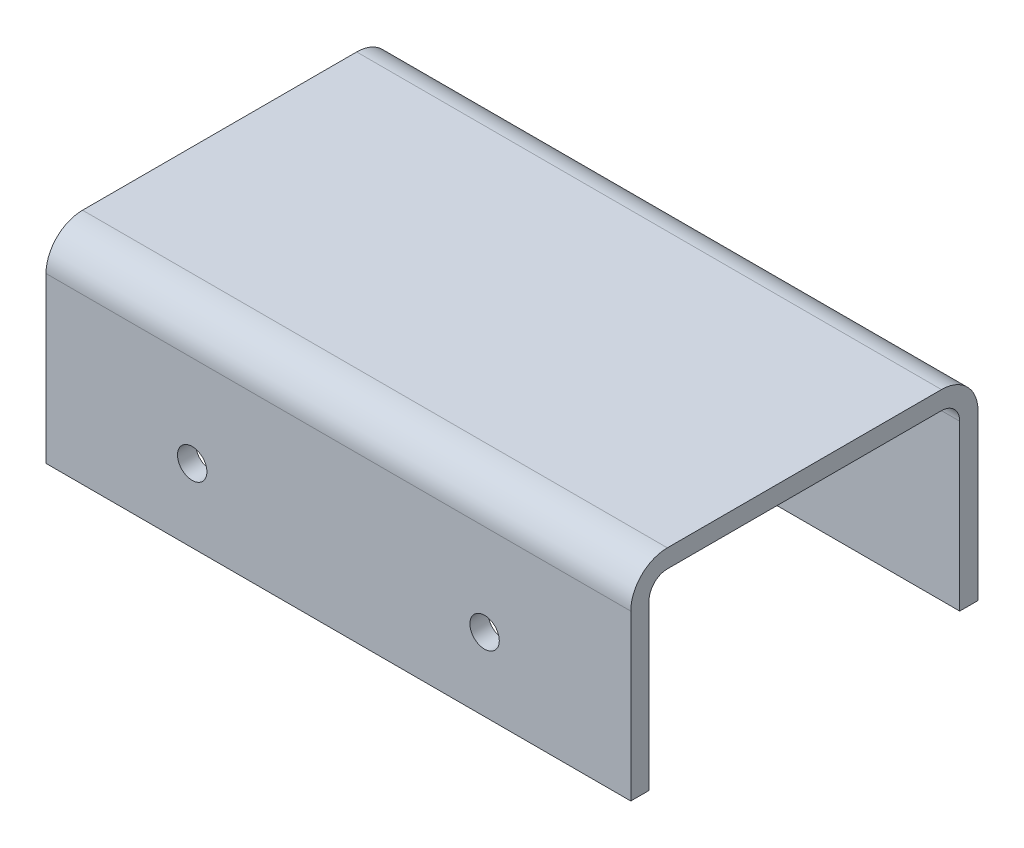
ISO-10303-21;
HEADER;
FILE_DESCRIPTION(('STEP AP214'),'2;1');
FILE_NAME('part.step','',(''),(''),'','','');
FILE_SCHEMA(('AUTOMOTIVE_DESIGN { 1 0 10303 214 1 1 1 1 }'));
ENDSEC;
DATA;
#1=APPLICATION_CONTEXT('core data for automotive mechanical design processes');
#2=APPLICATION_PROTOCOL_DEFINITION('international standard','automotive_design',2000,#1);
#3=PRODUCT_CONTEXT('',#1,'mechanical');
#4=PRODUCT('Part','Part','',(#3));
#5=PRODUCT_RELATED_PRODUCT_CATEGORY('part','',(#4));
#6=PRODUCT_DEFINITION_FORMATION('','',#4);
#7=PRODUCT_DEFINITION_CONTEXT('part definition',#1,'design');
#8=PRODUCT_DEFINITION('design','',#6,#7);
#9=PRODUCT_DEFINITION_SHAPE('','',#8);
#10=(LENGTH_UNIT() NAMED_UNIT(*) SI_UNIT(.MILLI.,.METRE.));
#11=(NAMED_UNIT(*) PLANE_ANGLE_UNIT() SI_UNIT($,.RADIAN.));
#12=(NAMED_UNIT(*) SI_UNIT($,.STERADIAN.) SOLID_ANGLE_UNIT());
#13=UNCERTAINTY_MEASURE_WITH_UNIT(LENGTH_MEASURE(1.E-05),#10,'distance_accuracy_value','');
#14=(GEOMETRIC_REPRESENTATION_CONTEXT(3) GLOBAL_UNCERTAINTY_ASSIGNED_CONTEXT((#13)) GLOBAL_UNIT_ASSIGNED_CONTEXT((#10,
#11,#12)) REPRESENTATION_CONTEXT('',''));
#15=CARTESIAN_POINT('',(0.,0.,0.));
#16=DIRECTION('',(0.,0.,1.));
#17=DIRECTION('',(1.,0.,0.));
#18=AXIS2_PLACEMENT_3D('',#15,#16,#17);
#19=CARTESIAN_POINT('',(-25.4,-22.225,-39.512875));
#20=DIRECTION('',(0.,0.,1.));
#21=DIRECTION('',(1.,0.,0.));
#22=AXIS2_PLACEMENT_3D('',#19,#20,#21);
#23=CYLINDRICAL_SURFACE('',#22,2.5527);
#24=CARTESIAN_POINT('',(-25.4,-22.225,30.1625));
#25=DIRECTION('',(0.,0.,1.));
#26=DIRECTION('',(1.,0.,0.));
#27=AXIS2_PLACEMENT_3D('',#24,#25,#26);
#28=CIRCLE('',#27,2.5527);
#29=CARTESIAN_POINT('',(-22.8473,-22.225,30.1625));
#30=VERTEX_POINT('',#29);
#31=EDGE_CURVE('P0_E168',#30,#30,#28,.F.);
#32=ORIENTED_EDGE('',*,*,#31,.F.);
#33=EDGE_LOOP('',(#32));
#34=FACE_BOUND('',#33,.T.);
#35=CARTESIAN_POINT('',(-25.4,-22.225,26.9875));
#36=DIRECTION('',(0.,0.,1.));
#37=DIRECTION('',(1.,0.,0.));
#38=AXIS2_PLACEMENT_3D('',#35,#36,#37);
#39=CIRCLE('',#38,2.5527);
#40=CARTESIAN_POINT('',(-22.8473,-22.225,26.9875));
#41=VERTEX_POINT('',#40);
#42=EDGE_CURVE('P0_E20',#41,#41,#39,.T.);
#43=ORIENTED_EDGE('',*,*,#42,.F.);
#44=EDGE_LOOP('',(#43));
#45=FACE_BOUND('',#44,.T.);
#46=ADVANCED_FACE('P0_F17',(#34,#45),#23,.F.);
#47=CARTESIAN_POINT('',(25.4,-22.225,-39.512875));
#48=DIRECTION('',(0.,0.,1.));
#49=DIRECTION('',(1.,0.,0.));
#50=AXIS2_PLACEMENT_3D('',#47,#48,#49);
#51=CYLINDRICAL_SURFACE('',#50,2.5527);
#52=CARTESIAN_POINT('',(25.4,-22.225,30.1625));
#53=DIRECTION('',(0.,0.,1.));
#54=DIRECTION('',(1.,0.,0.));
#55=AXIS2_PLACEMENT_3D('',#52,#53,#54);
#56=CIRCLE('',#55,2.5527);
#57=CARTESIAN_POINT('',(27.9527,-22.225,30.1625));
#58=VERTEX_POINT('',#57);
#59=EDGE_CURVE('P0_E178',#58,#58,#56,.F.);
#60=ORIENTED_EDGE('',*,*,#59,.F.);
#61=EDGE_LOOP('',(#60));
#62=FACE_BOUND('',#61,.T.);
#63=CARTESIAN_POINT('',(25.4,-22.225,26.9875));
#64=DIRECTION('',(0.,0.,1.));
#65=DIRECTION('',(1.,0.,0.));
#66=AXIS2_PLACEMENT_3D('',#63,#64,#65);
#67=CIRCLE('',#66,2.5527);
#68=CARTESIAN_POINT('',(27.9527,-22.225,26.9875));
#69=VERTEX_POINT('',#68);
#70=EDGE_CURVE('P0_E196',#69,#69,#67,.T.);
#71=ORIENTED_EDGE('',*,*,#70,.F.);
#72=EDGE_LOOP('',(#71));
#73=FACE_BOUND('',#72,.T.);
#74=ADVANCED_FACE('P0_F236',(#62,#73),#51,.F.);
#75=CARTESIAN_POINT('',(-50.8,-34.925,30.1625));
#76=DIRECTION('',(0.,-1.,0.));
#77=DIRECTION('',(0.,0.,-1.));
#78=AXIS2_PLACEMENT_3D('',#75,#76,#77);
#79=PLANE('',#78);
#80=DIRECTION('',(1.,0.,0.));
#81=VECTOR('',#80,1.);
#82=CARTESIAN_POINT('',(-50.8,-34.925,30.1625));
#83=LINE('',#82,#81);
#84=CARTESIAN_POINT('',(-50.8,-34.925,30.1625));
#85=VERTEX_POINT('',#84);
#86=CARTESIAN_POINT('',(50.8,-34.925,30.1625));
#87=VERTEX_POINT('',#86);
#88=EDGE_CURVE('P0_E165',#85,#87,#83,.T.);
#89=ORIENTED_EDGE('',*,*,#88,.F.);
#90=DIRECTION('',(0.,0.,-1.));
#91=VECTOR('',#90,1.);
#92=CARTESIAN_POINT('',(-50.8,-34.925,0.));
#93=LINE('',#92,#91);
#94=CARTESIAN_POINT('',(-50.8,-34.925,26.9875));
#95=VERTEX_POINT('',#94);
#96=EDGE_CURVE('P0_E171',#85,#95,#93,.T.);
#97=ORIENTED_EDGE('',*,*,#96,.T.);
#98=DIRECTION('',(-1.,0.,0.));
#99=VECTOR('',#98,1.);
#100=CARTESIAN_POINT('',(-50.8,-34.925,26.9875));
#101=LINE('',#100,#99);
#102=CARTESIAN_POINT('',(50.8,-34.925,26.9875));
#103=VERTEX_POINT('',#102);
#104=EDGE_CURVE('P0_E91',#103,#95,#101,.T.);
#105=ORIENTED_EDGE('',*,*,#104,.F.);
#106=DIRECTION('',(0.,0.,-1.));
#107=VECTOR('',#106,1.);
#108=CARTESIAN_POINT('',(50.8,-34.925,0.));
#109=LINE('',#108,#107);
#110=EDGE_CURVE('P0_E200',#87,#103,#109,.T.);
#111=ORIENTED_EDGE('',*,*,#110,.F.);
#112=EDGE_LOOP('',(#89,#97,#105,#111));
#113=FACE_BOUND('',#112,.T.);
#114=ADVANCED_FACE('P0_F242',(#113),#79,.T.);
#115=CARTESIAN_POINT('',(-50.8,-34.925,26.9875));
#116=DIRECTION('',(0.,0.,-1.));
#117=DIRECTION('',(-1.,0.,0.));
#118=AXIS2_PLACEMENT_3D('',#115,#116,#117);
#119=PLANE('',#118);
#120=ORIENTED_EDGE('',*,*,#70,.T.);
#121=EDGE_LOOP('',(#120));
#122=FACE_BOUND('',#121,.T.);
#123=ORIENTED_EDGE('',*,*,#42,.T.);
#124=EDGE_LOOP('',(#123));
#125=FACE_BOUND('',#124,.T.);
#126=ORIENTED_EDGE('',*,*,#104,.T.);
#127=DIRECTION('',(0.,1.,0.));
#128=VECTOR('',#127,1.);
#129=CARTESIAN_POINT('',(-50.8,0.,26.9875));
#130=LINE('',#129,#128);
#131=CARTESIAN_POINT('',(-50.8,-6.35,26.9875));
#132=VERTEX_POINT('',#131);
#133=EDGE_CURVE('P0_E173',#95,#132,#130,.T.);
#134=ORIENTED_EDGE('',*,*,#133,.T.);
#135=DIRECTION('',(1.,0.,0.));
#136=VECTOR('',#135,1.);
#137=CARTESIAN_POINT('',(-50.8,-6.35,26.9875));
#138=LINE('',#137,#136);
#139=CARTESIAN_POINT('',(50.8,-6.35,26.9875));
#140=VERTEX_POINT('',#139);
#141=EDGE_CURVE('P0_E82',#132,#140,#138,.T.);
#142=ORIENTED_EDGE('',*,*,#141,.T.);
#143=DIRECTION('',(0.,1.,0.));
#144=VECTOR('',#143,1.);
#145=CARTESIAN_POINT('',(50.8,0.,26.9875));
#146=LINE('',#145,#144);
#147=EDGE_CURVE('P0_E160',#103,#140,#146,.T.);
#148=ORIENTED_EDGE('',*,*,#147,.F.);
#149=EDGE_LOOP('',(#126,#134,#142,#148));
#150=FACE_BOUND('',#149,.T.);
#151=ADVANCED_FACE('P0_F233',(#122,#125,#150),#119,.T.);
#152=CARTESIAN_POINT('',(-50.8,-6.35,23.8125));
#153=DIRECTION('',(1.,0.,0.));
#154=DIRECTION('',(0.,0.,-1.));
#155=AXIS2_PLACEMENT_3D('',#152,#153,#154);
#156=CYLINDRICAL_SURFACE('',#155,3.175);
#157=CARTESIAN_POINT('',(50.8,-6.35,23.8125));
#158=DIRECTION('',(1.,0.,0.));
#159=DIRECTION('',(0.,0.,-1.));
#160=AXIS2_PLACEMENT_3D('',#157,#158,#159);
#161=CIRCLE('',#160,3.175);
#162=CARTESIAN_POINT('',(50.8,-3.175,23.8125));
#163=VERTEX_POINT('',#162);
#164=EDGE_CURVE('P0_E159',#140,#163,#161,.F.);
#165=ORIENTED_EDGE('',*,*,#164,.F.);
#166=ORIENTED_EDGE('',*,*,#141,.F.);
#167=CARTESIAN_POINT('',(-50.8,-6.35,23.8125));
#168=DIRECTION('',(1.,0.,0.));
#169=DIRECTION('',(0.,0.,-1.));
#170=AXIS2_PLACEMENT_3D('',#167,#168,#169);
#171=CIRCLE('',#170,3.175);
#172=CARTESIAN_POINT('',(-50.8,-3.175,23.8125));
#173=VERTEX_POINT('',#172);
#174=EDGE_CURVE('P0_E215',#132,#173,#171,.F.);
#175=ORIENTED_EDGE('',*,*,#174,.T.);
#176=DIRECTION('',(1.,0.,0.));
#177=VECTOR('',#176,1.);
#178=CARTESIAN_POINT('',(-50.8,-3.175,23.8125));
#179=LINE('',#178,#177);
#180=EDGE_CURVE('P0_E192',#163,#173,#179,.F.);
#181=ORIENTED_EDGE('',*,*,#180,.F.);
#182=EDGE_LOOP('',(#165,#166,#175,#181));
#183=FACE_BOUND('',#182,.T.);
#184=ADVANCED_FACE('P0_F284',(#183),#156,.F.);
#185=CARTESIAN_POINT('',(-50.8,-3.175,23.8125));
#186=DIRECTION('',(0.,-1.,0.));
#187=DIRECTION('',(0.,0.,-1.));
#188=AXIS2_PLACEMENT_3D('',#185,#186,#187);
#189=PLANE('',#188);
#190=ORIENTED_EDGE('',*,*,#180,.T.);
#191=DIRECTION('',(0.,0.,-1.));
#192=VECTOR('',#191,1.);
#193=CARTESIAN_POINT('',(-50.8,-3.175,0.));
#194=LINE('',#193,#192);
#195=CARTESIAN_POINT('',(-50.8,-3.175,-23.8125));
#196=VERTEX_POINT('',#195);
#197=EDGE_CURVE('P0_E214',#173,#196,#194,.T.);
#198=ORIENTED_EDGE('',*,*,#197,.T.);
#199=DIRECTION('',(1.,0.,0.));
#200=VECTOR('',#199,1.);
#201=CARTESIAN_POINT('',(-50.8,-3.175,-23.8125));
#202=LINE('',#201,#200);
#203=CARTESIAN_POINT('',(50.8,-3.175,-23.8125));
#204=VERTEX_POINT('',#203);
#205=EDGE_CURVE('P0_E190',#196,#204,#202,.T.);
#206=ORIENTED_EDGE('',*,*,#205,.T.);
#207=DIRECTION('',(0.,0.,-1.));
#208=VECTOR('',#207,1.);
#209=CARTESIAN_POINT('',(50.8,-3.175,0.));
#210=LINE('',#209,#208);
#211=EDGE_CURVE('P0_E150',#163,#204,#210,.T.);
#212=ORIENTED_EDGE('',*,*,#211,.F.);
#213=EDGE_LOOP('',(#190,#198,#206,#212));
#214=FACE_BOUND('',#213,.T.);
#215=ADVANCED_FACE('P0_F280',(#214),#189,.T.);
#216=CARTESIAN_POINT('',(-50.8,-6.35,-23.8125));
#217=DIRECTION('',(1.,0.,0.));
#218=DIRECTION('',(0.,0.,-1.));
#219=AXIS2_PLACEMENT_3D('',#216,#217,#218);
#220=CYLINDRICAL_SURFACE('',#219,3.175);
#221=CARTESIAN_POINT('',(50.8,-6.35,-23.8125));
#222=DIRECTION('',(1.,0.,0.));
#223=DIRECTION('',(0.,0.,-1.));
#224=AXIS2_PLACEMENT_3D('',#221,#222,#223);
#225=CIRCLE('',#224,3.175);
#226=CARTESIAN_POINT('',(50.8,-6.35,-26.9875));
#227=VERTEX_POINT('',#226);
#228=EDGE_CURVE('P0_E148',#204,#227,#225,.F.);
#229=ORIENTED_EDGE('',*,*,#228,.F.);
#230=ORIENTED_EDGE('',*,*,#205,.F.);
#231=CARTESIAN_POINT('',(-50.8,-6.35,-23.8125));
#232=DIRECTION('',(1.,0.,0.));
#233=DIRECTION('',(0.,0.,-1.));
#234=AXIS2_PLACEMENT_3D('',#231,#232,#233);
#235=CIRCLE('',#234,3.175);
#236=CARTESIAN_POINT('',(-50.8,-6.35,-26.9875));
#237=VERTEX_POINT('',#236);
#238=EDGE_CURVE('P0_E212',#196,#237,#235,.F.);
#239=ORIENTED_EDGE('',*,*,#238,.T.);
#240=DIRECTION('',(1.,0.,0.));
#241=VECTOR('',#240,1.);
#242=CARTESIAN_POINT('',(-50.8,-6.35,-26.9875));
#243=LINE('',#242,#241);
#244=EDGE_CURVE('P0_E135',#227,#237,#243,.F.);
#245=ORIENTED_EDGE('',*,*,#244,.F.);
#246=EDGE_LOOP('',(#229,#230,#239,#245));
#247=FACE_BOUND('',#246,.T.);
#248=ADVANCED_FACE('P0_F277',(#247),#220,.F.);
#249=CARTESIAN_POINT('',(-50.8,-6.35,-26.9875));
#250=DIRECTION('',(0.,0.,1.));
#251=DIRECTION('',(1.,0.,0.));
#252=AXIS2_PLACEMENT_3D('',#249,#250,#251);
#253=PLANE('',#252);
#254=ORIENTED_EDGE('',*,*,#244,.T.);
#255=DIRECTION('',(0.,1.,0.));
#256=VECTOR('',#255,1.);
#257=CARTESIAN_POINT('',(-50.8,0.,-26.9875));
#258=LINE('',#257,#256);
#259=CARTESIAN_POINT('',(-50.8,-34.925,-26.9875));
#260=VERTEX_POINT('',#259);
#261=EDGE_CURVE('P0_E133',#237,#260,#258,.F.);
#262=ORIENTED_EDGE('',*,*,#261,.T.);
#263=DIRECTION('',(1.,0.,0.));
#264=VECTOR('',#263,1.);
#265=CARTESIAN_POINT('',(-50.8,-34.925,-26.9875));
#266=LINE('',#265,#264);
#267=CARTESIAN_POINT('',(50.8,-34.925,-26.9875));
#268=VERTEX_POINT('',#267);
#269=EDGE_CURVE('P0_E125',#268,#260,#266,.F.);
#270=ORIENTED_EDGE('',*,*,#269,.F.);
#271=DIRECTION('',(0.,1.,0.));
#272=VECTOR('',#271,1.);
#273=CARTESIAN_POINT('',(50.8,0.,-26.9875));
#274=LINE('',#273,#272);
#275=EDGE_CURVE('P0_E130',#227,#268,#274,.F.);
#276=ORIENTED_EDGE('',*,*,#275,.F.);
#277=EDGE_LOOP('',(#254,#262,#270,#276));
#278=FACE_BOUND('',#277,.T.);
#279=ADVANCED_FACE('P0_F128',(#278),#253,.T.);
#280=CARTESIAN_POINT('',(-50.8,-34.925,-26.9875));
#281=DIRECTION('',(0.,-1.,0.));
#282=DIRECTION('',(0.,0.,-1.));
#283=AXIS2_PLACEMENT_3D('',#280,#281,#282);
#284=PLANE('',#283);
#285=ORIENTED_EDGE('',*,*,#269,.T.);
#286=DIRECTION('',(0.,0.,-1.));
#287=VECTOR('',#286,1.);
#288=CARTESIAN_POINT('',(-50.8,-34.925,0.));
#289=LINE('',#288,#287);
#290=CARTESIAN_POINT('',(-50.8,-34.925,-30.1625));
#291=VERTEX_POINT('',#290);
#292=EDGE_CURVE('P0_E116',#260,#291,#289,.T.);
#293=ORIENTED_EDGE('',*,*,#292,.T.);
#294=DIRECTION('',(-1.,0.,0.));
#295=VECTOR('',#294,1.);
#296=CARTESIAN_POINT('',(-50.8,-34.925,-30.1625));
#297=LINE('',#296,#295);
#298=CARTESIAN_POINT('',(50.8,-34.925,-30.1625));
#299=VERTEX_POINT('',#298);
#300=EDGE_CURVE('P0_E134',#299,#291,#297,.T.);
#301=ORIENTED_EDGE('',*,*,#300,.F.);
#302=DIRECTION('',(0.,0.,-1.));
#303=VECTOR('',#302,1.);
#304=CARTESIAN_POINT('',(50.8,-34.925,0.));
#305=LINE('',#304,#303);
#306=EDGE_CURVE('P0_E138',#268,#299,#305,.T.);
#307=ORIENTED_EDGE('',*,*,#306,.F.);
#308=EDGE_LOOP('',(#285,#293,#301,#307));
#309=FACE_BOUND('',#308,.T.);
#310=ADVANCED_FACE('P0_F139',(#309),#284,.T.);
#311=CARTESIAN_POINT('',(-50.8,-34.925,-30.1625));
#312=DIRECTION('',(0.,0.,-1.));
#313=DIRECTION('',(-1.,0.,0.));
#314=AXIS2_PLACEMENT_3D('',#311,#312,#313);
#315=PLANE('',#314);
#316=ORIENTED_EDGE('',*,*,#300,.T.);
#317=DIRECTION('',(0.,1.,0.));
#318=VECTOR('',#317,1.);
#319=CARTESIAN_POINT('',(-50.8,0.,-30.1625));
#320=LINE('',#319,#318);
#321=CARTESIAN_POINT('',(-50.8,-6.35,-30.1625));
#322=VERTEX_POINT('',#321);
#323=EDGE_CURVE('P0_E109',#291,#322,#320,.T.);
#324=ORIENTED_EDGE('',*,*,#323,.T.);
#325=DIRECTION('',(1.,0.,0.));
#326=VECTOR('',#325,1.);
#327=CARTESIAN_POINT('',(-50.8,-6.35,-30.1625));
#328=LINE('',#327,#326);
#329=CARTESIAN_POINT('',(50.8,-6.35,-30.1625));
#330=VERTEX_POINT('',#329);
#331=EDGE_CURVE('P0_E174',#330,#322,#328,.F.);
#332=ORIENTED_EDGE('',*,*,#331,.F.);
#333=DIRECTION('',(0.,1.,0.));
#334=VECTOR('',#333,1.);
#335=CARTESIAN_POINT('',(50.8,0.,-30.1625));
#336=LINE('',#335,#334);
#337=EDGE_CURVE('P0_E142',#299,#330,#336,.T.);
#338=ORIENTED_EDGE('',*,*,#337,.F.);
#339=EDGE_LOOP('',(#316,#324,#332,#338));
#340=FACE_BOUND('',#339,.T.);
#341=ADVANCED_FACE('P0_F269',(#340),#315,.T.);
#342=CARTESIAN_POINT('',(-50.8,-6.35,30.1625));
#343=DIRECTION('',(0.,0.,1.));
#344=DIRECTION('',(1.,0.,0.));
#345=AXIS2_PLACEMENT_3D('',#342,#343,#344);
#346=PLANE('',#345);
#347=ORIENTED_EDGE('',*,*,#59,.T.);
#348=EDGE_LOOP('',(#347));
#349=FACE_BOUND('',#348,.T.);
#350=ORIENTED_EDGE('',*,*,#31,.T.);
#351=EDGE_LOOP('',(#350));
#352=FACE_BOUND('',#351,.T.);
#353=DIRECTION('',(1.,0.,0.));
#354=VECTOR('',#353,1.);
#355=CARTESIAN_POINT('',(-50.8,-6.35,30.1625));
#356=LINE('',#355,#354);
#357=CARTESIAN_POINT('',(-50.8,-6.35,30.1625));
#358=VERTEX_POINT('',#357);
#359=CARTESIAN_POINT('',(50.8,-6.35,30.1625));
#360=VERTEX_POINT('',#359);
#361=EDGE_CURVE('P0_E101',#358,#360,#356,.T.);
#362=ORIENTED_EDGE('',*,*,#361,.F.);
#363=DIRECTION('',(0.,1.,0.));
#364=VECTOR('',#363,1.);
#365=CARTESIAN_POINT('',(-50.8,0.,30.1625));
#366=LINE('',#365,#364);
#367=EDGE_CURVE('P0_E210',#358,#85,#366,.F.);
#368=ORIENTED_EDGE('',*,*,#367,.T.);
#369=ORIENTED_EDGE('',*,*,#88,.T.);
#370=DIRECTION('',(0.,1.,0.));
#371=VECTOR('',#370,1.);
#372=CARTESIAN_POINT('',(50.8,0.,30.1625));
#373=LINE('',#372,#371);
#374=EDGE_CURVE('P0_E203',#360,#87,#373,.F.);
#375=ORIENTED_EDGE('',*,*,#374,.F.);
#376=EDGE_LOOP('',(#362,#368,#369,#375));
#377=FACE_BOUND('',#376,.T.);
#378=ADVANCED_FACE('P0_F265',(#349,#352,#377),#346,.T.);
#379=CARTESIAN_POINT('',(-50.8,-6.35,23.8125));
#380=DIRECTION('',(1.,0.,0.));
#381=DIRECTION('',(0.,0.,-1.));
#382=AXIS2_PLACEMENT_3D('',#379,#380,#381);
#383=CYLINDRICAL_SURFACE('',#382,6.35);
#384=DIRECTION('',(1.,0.,0.));
#385=VECTOR('',#384,1.);
#386=CARTESIAN_POINT('',(-50.8,0.,23.8125));
#387=LINE('',#386,#385);
#388=CARTESIAN_POINT('',(-50.8,0.,23.8125));
#389=VERTEX_POINT('',#388);
#390=CARTESIAN_POINT('',(50.8,0.,23.8125));
#391=VERTEX_POINT('',#390);
#392=EDGE_CURVE('P0_E298',#389,#391,#387,.T.);
#393=ORIENTED_EDGE('',*,*,#392,.F.);
#394=CARTESIAN_POINT('',(-50.8,-6.35,23.8125));
#395=DIRECTION('',(1.,0.,0.));
#396=DIRECTION('',(0.,0.,-1.));
#397=AXIS2_PLACEMENT_3D('',#394,#395,#396);
#398=CIRCLE('',#397,6.35);
#399=EDGE_CURVE('P0_E208',#389,#358,#398,.T.);
#400=ORIENTED_EDGE('',*,*,#399,.T.);
#401=ORIENTED_EDGE('',*,*,#361,.T.);
#402=CARTESIAN_POINT('',(50.8,-6.35,23.8125));
#403=DIRECTION('',(1.,0.,0.));
#404=DIRECTION('',(0.,0.,-1.));
#405=AXIS2_PLACEMENT_3D('',#402,#403,#404);
#406=CIRCLE('',#405,6.35);
#407=EDGE_CURVE('P0_E219',#391,#360,#406,.T.);
#408=ORIENTED_EDGE('',*,*,#407,.F.);
#409=EDGE_LOOP('',(#393,#400,#401,#408));
#410=FACE_BOUND('',#409,.T.);
#411=ADVANCED_FACE('P0_F262',(#410),#383,.T.);
#412=CARTESIAN_POINT('',(50.8,0.,0.));
#413=DIRECTION('',(1.,0.,0.));
#414=DIRECTION('',(0.,0.,-1.));
#415=AXIS2_PLACEMENT_3D('',#412,#413,#414);
#416=PLANE('',#415);
#417=ORIENTED_EDGE('',*,*,#374,.T.);
#418=ORIENTED_EDGE('',*,*,#110,.T.);
#419=ORIENTED_EDGE('',*,*,#147,.T.);
#420=ORIENTED_EDGE('',*,*,#164,.T.);
#421=ORIENTED_EDGE('',*,*,#211,.T.);
#422=ORIENTED_EDGE('',*,*,#228,.T.);
#423=ORIENTED_EDGE('',*,*,#275,.T.);
#424=ORIENTED_EDGE('',*,*,#306,.T.);
#425=ORIENTED_EDGE('',*,*,#337,.T.);
#426=CARTESIAN_POINT('',(50.8,-6.35,-23.8125));
#427=DIRECTION('',(1.,0.,0.));
#428=DIRECTION('',(0.,0.,-1.));
#429=AXIS2_PLACEMENT_3D('',#426,#427,#428);
#430=CIRCLE('',#429,6.35);
#431=CARTESIAN_POINT('',(50.8,0.,-23.8125));
#432=VERTEX_POINT('',#431);
#433=EDGE_CURVE('P0_E180',#432,#330,#430,.F.);
#434=ORIENTED_EDGE('',*,*,#433,.F.);
#435=DIRECTION('',(0.,0.,1.));
#436=VECTOR('',#435,1.);
#437=CARTESIAN_POINT('',(50.8,0.,-23.8125));
#438=LINE('',#437,#436);
#439=EDGE_CURVE('P0_E309',#391,#432,#438,.F.);
#440=ORIENTED_EDGE('',*,*,#439,.F.);
#441=ORIENTED_EDGE('',*,*,#407,.T.);
#442=EDGE_LOOP('',(#417,#418,#419,#420,#421,#422,#423,#424,#425,#434,#440,#441));
#443=FACE_BOUND('',#442,.T.);
#444=ADVANCED_FACE('P0_F145',(#443),#416,.T.);
#445=CARTESIAN_POINT('',(-50.8,-6.35,-23.8125));
#446=DIRECTION('',(1.,0.,0.));
#447=DIRECTION('',(0.,0.,-1.));
#448=AXIS2_PLACEMENT_3D('',#445,#446,#447);
#449=CYLINDRICAL_SURFACE('',#448,6.35);
#450=ORIENTED_EDGE('',*,*,#331,.T.);
#451=CARTESIAN_POINT('',(-50.8,-6.35,-23.8125));
#452=DIRECTION('',(1.,0.,0.));
#453=DIRECTION('',(0.,0.,-1.));
#454=AXIS2_PLACEMENT_3D('',#451,#452,#453);
#455=CIRCLE('',#454,6.35);
#456=CARTESIAN_POINT('',(-50.8,0.,-23.8125));
#457=VERTEX_POINT('',#456);
#458=EDGE_CURVE('P0_E35',#322,#457,#455,.T.);
#459=ORIENTED_EDGE('',*,*,#458,.T.);
#460=DIRECTION('',(1.,0.,0.));
#461=VECTOR('',#460,1.);
#462=CARTESIAN_POINT('',(-50.8,0.,-23.8125));
#463=LINE('',#462,#461);
#464=EDGE_CURVE('P0_E26',#432,#457,#463,.F.);
#465=ORIENTED_EDGE('',*,*,#464,.F.);
#466=ORIENTED_EDGE('',*,*,#433,.T.);
#467=EDGE_LOOP('',(#450,#459,#465,#466));
#468=FACE_BOUND('',#467,.T.);
#469=ADVANCED_FACE('P0_F253',(#468),#449,.T.);
#470=CARTESIAN_POINT('',(-50.8,0.,0.));
#471=DIRECTION('',(1.,0.,0.));
#472=DIRECTION('',(0.,0.,-1.));
#473=AXIS2_PLACEMENT_3D('',#470,#471,#472);
#474=PLANE('',#473);
#475=ORIENTED_EDGE('',*,*,#399,.F.);
#476=DIRECTION('',(0.,0.,1.));
#477=VECTOR('',#476,1.);
#478=CARTESIAN_POINT('',(-50.8,0.,-23.8125));
#479=LINE('',#478,#477);
#480=EDGE_CURVE('P0_E11',#457,#389,#479,.T.);
#481=ORIENTED_EDGE('',*,*,#480,.F.);
#482=ORIENTED_EDGE('',*,*,#458,.F.);
#483=ORIENTED_EDGE('',*,*,#323,.F.);
#484=ORIENTED_EDGE('',*,*,#292,.F.);
#485=ORIENTED_EDGE('',*,*,#261,.F.);
#486=ORIENTED_EDGE('',*,*,#238,.F.);
#487=ORIENTED_EDGE('',*,*,#197,.F.);
#488=ORIENTED_EDGE('',*,*,#174,.F.);
#489=ORIENTED_EDGE('',*,*,#133,.F.);
#490=ORIENTED_EDGE('',*,*,#96,.F.);
#491=ORIENTED_EDGE('',*,*,#367,.F.);
#492=EDGE_LOOP('',(#475,#481,#482,#483,#484,#485,#486,#487,#488,#489,#490,#491));
#493=FACE_BOUND('',#492,.T.);
#494=ADVANCED_FACE('P0_F247',(#493),#474,.F.);
#495=CARTESIAN_POINT('',(-50.8,0.,-23.8125));
#496=DIRECTION('',(0.,1.,0.));
#497=DIRECTION('',(0.,0.,1.));
#498=AXIS2_PLACEMENT_3D('',#495,#496,#497);
#499=PLANE('',#498);
#500=ORIENTED_EDGE('',*,*,#464,.T.);
#501=ORIENTED_EDGE('',*,*,#480,.T.);
#502=ORIENTED_EDGE('',*,*,#392,.T.);
#503=ORIENTED_EDGE('',*,*,#439,.T.);
#504=EDGE_LOOP('',(#500,#501,#502,#503));
#505=FACE_BOUND('',#504,.T.);
#506=ADVANCED_FACE('P0_F245',(#505),#499,.T.);
#507=CLOSED_SHELL('',(#46,#74,#114,#151,#184,#215,#248,#279,#310,#341,#378,#411,#444,#469,#494,#506));
#508=MANIFOLD_SOLID_BREP('P0_B1',#507);
#509=CARTESIAN_POINT('',(25.4,-22.225,-39.512875));
#510=DIRECTION('',(0.,0.,1.));
#511=DIRECTION('',(1.,0.,0.));
#512=AXIS2_PLACEMENT_3D('',#509,#510,#511);
#513=CYLINDRICAL_SURFACE('',#512,3.175);
#514=CARTESIAN_POINT('',(25.4,-22.225,30.1625));
#515=DIRECTION('',(0.,0.,1.));
#516=DIRECTION('',(1.,0.,0.));
#517=AXIS2_PLACEMENT_3D('',#514,#515,#516);
#518=CIRCLE('',#517,3.175);
#519=CARTESIAN_POINT('',(28.575,-22.225,30.1625));
#520=VERTEX_POINT('',#519);
#521=EDGE_CURVE('P1_E10',#520,#520,#518,.F.);
#522=ORIENTED_EDGE('',*,*,#521,.T.);
#523=EDGE_LOOP('',(#522));
#524=FACE_BOUND('',#523,.T.);
#525=CARTESIAN_POINT('',(25.4,-22.225,26.9875));
#526=DIRECTION('',(0.,0.,1.));
#527=DIRECTION('',(1.,0.,0.));
#528=AXIS2_PLACEMENT_3D('',#525,#526,#527);
#529=CIRCLE('',#528,3.175);
#530=CARTESIAN_POINT('',(28.575,-22.225,26.9875));
#531=VERTEX_POINT('',#530);
#532=EDGE_CURVE('P1_E16',#531,#531,#529,.T.);
#533=ORIENTED_EDGE('',*,*,#532,.T.);
#534=EDGE_LOOP('',(#533));
#535=FACE_BOUND('',#534,.T.);
#536=ADVANCED_FACE('P1_F15',(#524,#535),#513,.T.);
#537=OPEN_SHELL('',(#536));
#538=SHELL_BASED_SURFACE_MODEL('P1_B1',(#537));
#539=CARTESIAN_POINT('',(-25.4,-22.225,-39.512875));
#540=DIRECTION('',(0.,0.,1.));
#541=DIRECTION('',(1.,0.,0.));
#542=AXIS2_PLACEMENT_3D('',#539,#540,#541);
#543=CYLINDRICAL_SURFACE('',#542,3.175);
#544=CARTESIAN_POINT('',(-25.4,-22.225,30.1625));
#545=DIRECTION('',(0.,0.,1.));
#546=DIRECTION('',(1.,0.,0.));
#547=AXIS2_PLACEMENT_3D('',#544,#545,#546);
#548=CIRCLE('',#547,3.175);
#549=CARTESIAN_POINT('',(-22.225,-22.225,30.1625));
#550=VERTEX_POINT('',#549);
#551=EDGE_CURVE('P2_E10',#550,#550,#548,.F.);
#552=ORIENTED_EDGE('',*,*,#551,.T.);
#553=EDGE_LOOP('',(#552));
#554=FACE_BOUND('',#553,.T.);
#555=CARTESIAN_POINT('',(-25.4,-22.225,26.9875));
#556=DIRECTION('',(0.,0.,1.));
#557=DIRECTION('',(1.,0.,0.));
#558=AXIS2_PLACEMENT_3D('',#555,#556,#557);
#559=CIRCLE('',#558,3.175);
#560=CARTESIAN_POINT('',(-22.225,-22.225,26.9875));
#561=VERTEX_POINT('',#560);
#562=EDGE_CURVE('P2_E16',#561,#561,#559,.T.);
#563=ORIENTED_EDGE('',*,*,#562,.T.);
#564=EDGE_LOOP('',(#563));
#565=FACE_BOUND('',#564,.T.);
#566=ADVANCED_FACE('P2_F15',(#554,#565),#543,.T.);
#567=OPEN_SHELL('',(#566));
#568=SHELL_BASED_SURFACE_MODEL('P2_B1',(#567));
#569=ADVANCED_BREP_SHAPE_REPRESENTATION('',(#18,#508),#14);
#570=MANIFOLD_SURFACE_SHAPE_REPRESENTATION('',(#18,#538,#568),#14);
#571=SHAPE_REPRESENTATION('',(#18),#14);
#572=SHAPE_DEFINITION_REPRESENTATION(#9,#571);
#573=SHAPE_REPRESENTATION_RELATIONSHIP('','',#571,#569);
#574=SHAPE_REPRESENTATION_RELATIONSHIP('','',#571,#570);
ENDSEC;
END-ISO-10303-21;
